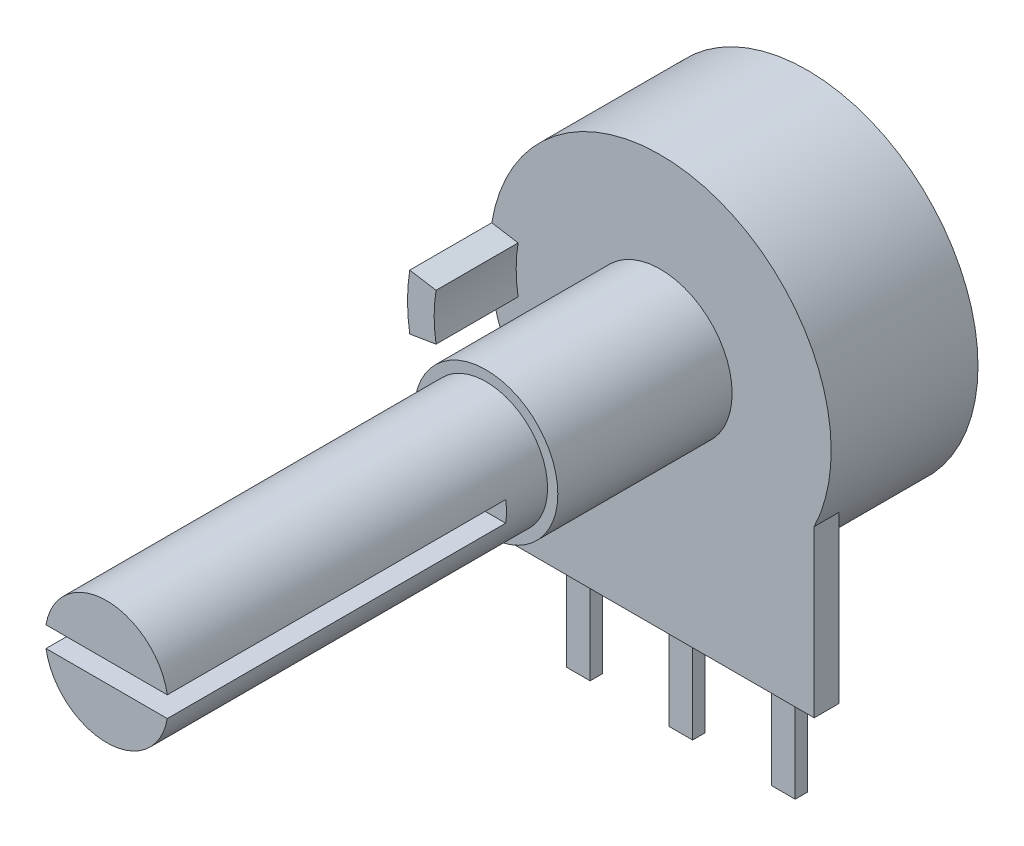
ISO-10303-21;
HEADER;
FILE_DESCRIPTION(('STEP AP214'),'2;1');
FILE_NAME('part.step','',(''),(''),'','','');
FILE_SCHEMA(('AUTOMOTIVE_DESIGN { 1 0 10303 214 1 1 1 1 }'));
ENDSEC;
DATA;
#1=APPLICATION_CONTEXT('core data for automotive mechanical design processes');
#2=APPLICATION_PROTOCOL_DEFINITION('international standard','automotive_design',2000,#1);
#3=PRODUCT_CONTEXT('',#1,'mechanical');
#4=PRODUCT('Part','Part','',(#3));
#5=PRODUCT_RELATED_PRODUCT_CATEGORY('part','',(#4));
#6=PRODUCT_DEFINITION_FORMATION('','',#4);
#7=PRODUCT_DEFINITION_CONTEXT('part definition',#1,'design');
#8=PRODUCT_DEFINITION('design','',#6,#7);
#9=PRODUCT_DEFINITION_SHAPE('','',#8);
#10=(LENGTH_UNIT() NAMED_UNIT(*) SI_UNIT(.MILLI.,.METRE.));
#11=(NAMED_UNIT(*) PLANE_ANGLE_UNIT() SI_UNIT($,.RADIAN.));
#12=(NAMED_UNIT(*) SI_UNIT($,.STERADIAN.) SOLID_ANGLE_UNIT());
#13=UNCERTAINTY_MEASURE_WITH_UNIT(LENGTH_MEASURE(1.E-05),#10,'distance_accuracy_value','');
#14=(GEOMETRIC_REPRESENTATION_CONTEXT(3) GLOBAL_UNCERTAINTY_ASSIGNED_CONTEXT((#13)) GLOBAL_UNIT_ASSIGNED_CONTEXT((#10,
#11,#12)) REPRESENTATION_CONTEXT('',''));
#15=CARTESIAN_POINT('',(0.,0.,0.));
#16=DIRECTION('',(0.,0.,1.));
#17=DIRECTION('',(1.,0.,0.));
#18=AXIS2_PLACEMENT_3D('',#15,#16,#17);
#19=CARTESIAN_POINT('',(0.,0.,7.16));
#20=DIRECTION('',(0.,0.,1.));
#21=DIRECTION('',(1.,0.,0.));
#22=AXIS2_PLACEMENT_3D('',#19,#20,#21);
#23=PLANE('',#22);
#24=CARTESIAN_POINT('',(0.,0.,7.16));
#25=DIRECTION('',(0.,0.,1.));
#26=DIRECTION('',(1.,0.,0.));
#27=AXIS2_PLACEMENT_3D('',#24,#25,#26);
#28=CIRCLE('',#27,3.5);
#29=CARTESIAN_POINT('',(3.5,0.,7.16));
#30=VERTEX_POINT('',#29);
#31=EDGE_CURVE('E400',#30,#30,#28,.T.);
#32=ORIENTED_EDGE('',*,*,#31,.F.);
#33=EDGE_LOOP('',(#32));
#34=FACE_BOUND('',#33,.T.);
#35=CARTESIAN_POINT('',(0.,0.,7.16));
#36=DIRECTION('',(0.,0.,1.));
#37=DIRECTION('',(1.,0.,0.));
#38=AXIS2_PLACEMENT_3D('',#35,#36,#37);
#39=CIRCLE('',#38,8.33);
#40=CARTESIAN_POINT('',(7.5,-3.62476206115657,7.16));
#41=VERTEX_POINT('',#40);
#42=CARTESIAN_POINT('',(-8.21987834459854,1.35,7.16));
#43=VERTEX_POINT('',#42);
#44=EDGE_CURVE('E404',#41,#43,#39,.T.);
#45=ORIENTED_EDGE('',*,*,#44,.T.);
#46=DIRECTION('',(-0.986780113397183,0.162064825930372,0.));
#47=VECTOR('',#46,1.);
#48=CARTESIAN_POINT('',(-8.21987834459854,1.35,7.16));
#49=LINE('',#48,#47);
#50=CARTESIAN_POINT('',(-6.9370641971822,1.13931572629052,7.16));
#51=VERTEX_POINT('',#50);
#52=EDGE_CURVE('E476',#51,#43,#49,.T.);
#53=ORIENTED_EDGE('',*,*,#52,.F.);
#54=CARTESIAN_POINT('',(0.,0.,7.16));
#55=DIRECTION('',(0.,0.,-1.));
#56=DIRECTION('',(-1.,0.,0.));
#57=AXIS2_PLACEMENT_3D('',#54,#55,#56);
#58=CIRCLE('',#57,7.03);
#59=CARTESIAN_POINT('',(-6.9370641971822,-1.13931572629052,7.16));
#60=VERTEX_POINT('',#59);
#61=EDGE_CURVE('E243',#60,#51,#58,.T.);
#62=ORIENTED_EDGE('',*,*,#61,.F.);
#63=DIRECTION('',(0.986780113397183,0.162064825930372,0.));
#64=VECTOR('',#63,1.);
#65=CARTESIAN_POINT('',(-8.21987834459854,-1.35,7.16));
#66=LINE('',#65,#64);
#67=CARTESIAN_POINT('',(-8.21987834459854,-1.35,7.16));
#68=VERTEX_POINT('',#67);
#69=EDGE_CURVE('E239',#68,#60,#66,.T.);
#70=ORIENTED_EDGE('',*,*,#69,.F.);
#71=CARTESIAN_POINT('',(-7.5,-3.62476206115657,7.16));
#72=VERTEX_POINT('',#71);
#73=EDGE_CURVE('E407',#68,#72,#39,.T.);
#74=ORIENTED_EDGE('',*,*,#73,.T.);
#75=DIRECTION('',(0.,-1.,0.));
#76=VECTOR('',#75,1.);
#77=CARTESIAN_POINT('',(-7.5,-11.7,7.16));
#78=LINE('',#77,#76);
#79=CARTESIAN_POINT('',(-7.5,-11.7,7.16));
#80=VERTEX_POINT('',#79);
#81=EDGE_CURVE('E359',#72,#80,#78,.T.);
#82=ORIENTED_EDGE('',*,*,#81,.T.);
#83=DIRECTION('',(1.,0.,0.));
#84=VECTOR('',#83,1.);
#85=CARTESIAN_POINT('',(-7.5,-11.7,7.16));
#86=LINE('',#85,#84);
#87=CARTESIAN_POINT('',(7.5,-11.7,7.16));
#88=VERTEX_POINT('',#87);
#89=EDGE_CURVE('E349',#80,#88,#86,.T.);
#90=ORIENTED_EDGE('',*,*,#89,.T.);
#91=DIRECTION('',(0.,1.,0.));
#92=VECTOR('',#91,1.);
#93=CARTESIAN_POINT('',(7.5,-11.7,7.16));
#94=LINE('',#93,#92);
#95=EDGE_CURVE('E344',#88,#41,#94,.T.);
#96=ORIENTED_EDGE('',*,*,#95,.T.);
#97=EDGE_LOOP('',(#45,#53,#62,#70,#74,#82,#90,#96));
#98=FACE_BOUND('',#97,.T.);
#99=ADVANCED_FACE('F38',(#34,#98),#23,.T.);
#100=CARTESIAN_POINT('',(0.,0.,34.16));
#101=DIRECTION('',(0.,0.,1.));
#102=DIRECTION('',(1.,0.,0.));
#103=AXIS2_PLACEMENT_3D('',#100,#101,#102);
#104=PLANE('',#103);
#105=DIRECTION('',(-1.,0.,0.));
#106=VECTOR('',#105,1.);
#107=CARTESIAN_POINT('',(0.,0.5,34.16));
#108=LINE('',#107,#106);
#109=CARTESIAN_POINT('',(2.95803989154981,0.5,34.16));
#110=VERTEX_POINT('',#109);
#111=CARTESIAN_POINT('',(-2.95803989154981,0.5,34.16));
#112=VERTEX_POINT('',#111);
#113=EDGE_CURVE('E413',#110,#112,#108,.T.);
#114=ORIENTED_EDGE('',*,*,#113,.F.);
#115=CARTESIAN_POINT('',(0.,0.,34.16));
#116=DIRECTION('',(0.,0.,1.));
#117=DIRECTION('',(1.,0.,0.));
#118=AXIS2_PLACEMENT_3D('',#115,#116,#117);
#119=CIRCLE('',#118,3.);
#120=EDGE_CURVE('E394',#110,#112,#119,.T.);
#121=ORIENTED_EDGE('',*,*,#120,.T.);
#122=EDGE_LOOP('',(#114,#121));
#123=FACE_BOUND('',#122,.T.);
#124=ADVANCED_FACE('F520',(#123),#104,.T.);
#125=CARTESIAN_POINT('',(0.,0.,7.16));
#126=DIRECTION('',(0.,0.,-1.));
#127=DIRECTION('',(-1.,0.,0.));
#128=AXIS2_PLACEMENT_3D('',#125,#126,#127);
#129=CYLINDRICAL_SURFACE('',#128,8.33);
#130=ORIENTED_EDGE('',*,*,#44,.F.);
#131=DIRECTION('',(0.,0.,-1.));
#132=VECTOR('',#131,1.);
#133=CARTESIAN_POINT('',(7.5,-3.62476206115657,7.16));
#134=LINE('',#133,#132);
#135=CARTESIAN_POINT('',(7.5,-3.62476206115657,5.96));
#136=VERTEX_POINT('',#135);
#137=EDGE_CURVE('E370',#41,#136,#134,.T.);
#138=ORIENTED_EDGE('',*,*,#137,.T.);
#139=CARTESIAN_POINT('',(0.,0.,5.96));
#140=DIRECTION('',(0.,0.,-1.));
#141=DIRECTION('',(-1.,0.,0.));
#142=AXIS2_PLACEMENT_3D('',#139,#140,#141);
#143=CIRCLE('',#142,8.33);
#144=CARTESIAN_POINT('',(-7.5,-3.62476206115657,5.96));
#145=VERTEX_POINT('',#144);
#146=EDGE_CURVE('E42',#136,#145,#143,.T.);
#147=ORIENTED_EDGE('',*,*,#146,.T.);
#148=DIRECTION('',(0.,0.,-1.));
#149=VECTOR('',#148,1.);
#150=CARTESIAN_POINT('',(-7.5,-3.62476206115657,7.16));
#151=LINE('',#150,#149);
#152=EDGE_CURVE('E365',#145,#72,#151,.F.);
#153=ORIENTED_EDGE('',*,*,#152,.T.);
#154=ORIENTED_EDGE('',*,*,#73,.F.);
#155=DIRECTION('',(0.,0.,-1.));
#156=VECTOR('',#155,1.);
#157=CARTESIAN_POINT('',(-8.21987834459854,-1.35,11.16));
#158=LINE('',#157,#156);
#159=CARTESIAN_POINT('',(-8.21987834459854,-1.35,11.16));
#160=VERTEX_POINT('',#159);
#161=EDGE_CURVE('E56',#160,#68,#158,.T.);
#162=ORIENTED_EDGE('',*,*,#161,.F.);
#163=CARTESIAN_POINT('',(0.,0.,11.16));
#164=DIRECTION('',(0.,0.,1.));
#165=DIRECTION('',(-1.,0.,0.));
#166=AXIS2_PLACEMENT_3D('',#163,#164,#165);
#167=CIRCLE('',#166,8.33);
#168=CARTESIAN_POINT('',(-8.21987834459854,1.35,11.16));
#169=VERTEX_POINT('',#168);
#170=EDGE_CURVE('E230',#169,#160,#167,.T.);
#171=ORIENTED_EDGE('',*,*,#170,.F.);
#172=DIRECTION('',(0.,0.,-1.));
#173=VECTOR('',#172,1.);
#174=CARTESIAN_POINT('',(-8.21987834459854,1.35,11.16));
#175=LINE('',#174,#173);
#176=EDGE_CURVE('E227',#169,#43,#175,.T.);
#177=ORIENTED_EDGE('',*,*,#176,.T.);
#178=EDGE_LOOP('',(#130,#138,#147,#153,#154,#162,#171,#177));
#179=FACE_BOUND('',#178,.T.);
#180=CARTESIAN_POINT('',(0.,0.,0.));
#181=DIRECTION('',(0.,0.,1.));
#182=DIRECTION('',(1.,0.,0.));
#183=AXIS2_PLACEMENT_3D('',#180,#181,#182);
#184=CIRCLE('',#183,8.33);
#185=CARTESIAN_POINT('',(8.33,0.,0.));
#186=VERTEX_POINT('',#185);
#187=EDGE_CURVE('E398',#186,#186,#184,.T.);
#188=ORIENTED_EDGE('',*,*,#187,.T.);
#189=EDGE_LOOP('',(#188));
#190=FACE_BOUND('',#189,.T.);
#191=ADVANCED_FACE('F40',(#179,#190),#129,.T.);
#192=CARTESIAN_POINT('',(0.,0.,0.));
#193=DIRECTION('',(0.,0.,1.));
#194=DIRECTION('',(1.,0.,0.));
#195=AXIS2_PLACEMENT_3D('',#192,#193,#194);
#196=PLANE('',#195);
#197=ORIENTED_EDGE('',*,*,#187,.F.);
#198=EDGE_LOOP('',(#197));
#199=FACE_BOUND('',#198,.T.);
#200=ADVANCED_FACE('F533',(#199),#196,.F.);
#201=CARTESIAN_POINT('',(0.,0.,15.66));
#202=DIRECTION('',(0.,0.,-1.));
#203=DIRECTION('',(-1.,0.,0.));
#204=AXIS2_PLACEMENT_3D('',#201,#202,#203);
#205=CYLINDRICAL_SURFACE('',#204,3.5);
#206=CARTESIAN_POINT('',(0.,0.,15.66));
#207=DIRECTION('',(0.,0.,1.));
#208=DIRECTION('',(1.,0.,0.));
#209=AXIS2_PLACEMENT_3D('',#206,#207,#208);
#210=CIRCLE('',#209,3.5);
#211=CARTESIAN_POINT('',(3.5,0.,15.66));
#212=VERTEX_POINT('',#211);
#213=EDGE_CURVE('E395',#212,#212,#210,.T.);
#214=ORIENTED_EDGE('',*,*,#213,.F.);
#215=EDGE_LOOP('',(#214));
#216=FACE_BOUND('',#215,.T.);
#217=ORIENTED_EDGE('',*,*,#31,.T.);
#218=EDGE_LOOP('',(#217));
#219=FACE_BOUND('',#218,.T.);
#220=ADVANCED_FACE('F531',(#216,#219),#205,.T.);
#221=CARTESIAN_POINT('',(0.,0.,15.66));
#222=DIRECTION('',(0.,0.,1.));
#223=DIRECTION('',(1.,0.,0.));
#224=AXIS2_PLACEMENT_3D('',#221,#222,#223);
#225=PLANE('',#224);
#226=CARTESIAN_POINT('',(0.,0.,15.66));
#227=DIRECTION('',(0.,0.,1.));
#228=DIRECTION('',(1.,0.,0.));
#229=AXIS2_PLACEMENT_3D('',#226,#227,#228);
#230=CIRCLE('',#229,3.);
#231=CARTESIAN_POINT('',(3.,0.,15.66));
#232=VERTEX_POINT('',#231);
#233=EDGE_CURVE('E399',#232,#232,#230,.F.);
#234=ORIENTED_EDGE('',*,*,#233,.T.);
#235=EDGE_LOOP('',(#234));
#236=FACE_BOUND('',#235,.T.);
#237=ORIENTED_EDGE('',*,*,#213,.T.);
#238=EDGE_LOOP('',(#237));
#239=FACE_BOUND('',#238,.T.);
#240=ADVANCED_FACE('F540',(#236,#239),#225,.T.);
#241=CARTESIAN_POINT('',(0.,0.,34.16));
#242=DIRECTION('',(0.,0.,-1.));
#243=DIRECTION('',(-1.,0.,0.));
#244=AXIS2_PLACEMENT_3D('',#241,#242,#243);
#245=CYLINDRICAL_SURFACE('',#244,3.);
#246=CARTESIAN_POINT('',(0.,0.,17.66));
#247=DIRECTION('',(0.,0.,1.));
#248=DIRECTION('',(1.,0.,0.));
#249=AXIS2_PLACEMENT_3D('',#246,#247,#248);
#250=CIRCLE('',#249,3.);
#251=CARTESIAN_POINT('',(-2.95803989154981,0.5,17.66));
#252=VERTEX_POINT('',#251);
#253=CARTESIAN_POINT('',(-2.95803989154981,-0.5,17.66));
#254=VERTEX_POINT('',#253);
#255=EDGE_CURVE('E415',#252,#254,#250,.T.);
#256=ORIENTED_EDGE('',*,*,#255,.F.);
#257=DIRECTION('',(0.,0.,-1.));
#258=VECTOR('',#257,1.);
#259=CARTESIAN_POINT('',(-2.95803989154981,0.5,34.16));
#260=LINE('',#259,#258);
#261=EDGE_CURVE('E385',#252,#112,#260,.F.);
#262=ORIENTED_EDGE('',*,*,#261,.T.);
#263=ORIENTED_EDGE('',*,*,#120,.F.);
#264=DIRECTION('',(0.,0.,-1.));
#265=VECTOR('',#264,1.);
#266=CARTESIAN_POINT('',(2.95803989154981,0.5,34.16));
#267=LINE('',#266,#265);
#268=CARTESIAN_POINT('',(2.95803989154981,0.5,17.66));
#269=VERTEX_POINT('',#268);
#270=EDGE_CURVE('E388',#110,#269,#267,.T.);
#271=ORIENTED_EDGE('',*,*,#270,.T.);
#272=CARTESIAN_POINT('',(2.95803989154981,-0.5,17.66));
#273=VERTEX_POINT('',#272);
#274=EDGE_CURVE('E414',#273,#269,#250,.T.);
#275=ORIENTED_EDGE('',*,*,#274,.F.);
#276=DIRECTION('',(0.,0.,-1.));
#277=VECTOR('',#276,1.);
#278=CARTESIAN_POINT('',(2.95803989154981,-0.5,34.16));
#279=LINE('',#278,#277);
#280=CARTESIAN_POINT('',(2.95803989154981,-0.5,34.16));
#281=VERTEX_POINT('',#280);
#282=EDGE_CURVE('E379',#273,#281,#279,.F.);
#283=ORIENTED_EDGE('',*,*,#282,.T.);
#284=CARTESIAN_POINT('',(-2.95803989154981,-0.5,34.16));
#285=VERTEX_POINT('',#284);
#286=EDGE_CURVE('E391',#285,#281,#119,.T.);
#287=ORIENTED_EDGE('',*,*,#286,.F.);
#288=DIRECTION('',(0.,0.,-1.));
#289=VECTOR('',#288,1.);
#290=CARTESIAN_POINT('',(-2.95803989154981,-0.5,34.16));
#291=LINE('',#290,#289);
#292=EDGE_CURVE('E382',#285,#254,#291,.T.);
#293=ORIENTED_EDGE('',*,*,#292,.T.);
#294=EDGE_LOOP('',(#256,#262,#263,#271,#275,#283,#287,#293));
#295=FACE_BOUND('',#294,.T.);
#296=ORIENTED_EDGE('',*,*,#233,.F.);
#297=EDGE_LOOP('',(#296));
#298=FACE_BOUND('',#297,.T.);
#299=ADVANCED_FACE('F561',(#295,#298),#245,.T.);
#300=DIRECTION('',(1.,0.,0.));
#301=VECTOR('',#300,1.);
#302=CARTESIAN_POINT('',(0.,-0.5,34.16));
#303=LINE('',#302,#301);
#304=EDGE_CURVE('E403',#285,#281,#303,.T.);
#305=ORIENTED_EDGE('',*,*,#304,.F.);
#306=ORIENTED_EDGE('',*,*,#286,.T.);
#307=EDGE_LOOP('',(#305,#306));
#308=FACE_BOUND('',#307,.T.);
#309=ADVANCED_FACE('F528',(#308),#104,.T.);
#310=CARTESIAN_POINT('',(0.,0.,17.66));
#311=DIRECTION('',(0.,0.,1.));
#312=DIRECTION('',(1.,0.,0.));
#313=AXIS2_PLACEMENT_3D('',#310,#311,#312);
#314=PLANE('',#313);
#315=DIRECTION('',(1.,0.,0.));
#316=VECTOR('',#315,1.);
#317=CARTESIAN_POINT('',(-3.,0.5,17.66));
#318=LINE('',#317,#316);
#319=EDGE_CURVE('E373',#252,#269,#318,.T.);
#320=ORIENTED_EDGE('',*,*,#319,.F.);
#321=ORIENTED_EDGE('',*,*,#255,.T.);
#322=DIRECTION('',(-1.,0.,0.));
#323=VECTOR('',#322,1.);
#324=CARTESIAN_POINT('',(-3.,-0.5,17.66));
#325=LINE('',#324,#323);
#326=EDGE_CURVE('E376',#273,#254,#325,.T.);
#327=ORIENTED_EDGE('',*,*,#326,.F.);
#328=ORIENTED_EDGE('',*,*,#274,.T.);
#329=EDGE_LOOP('',(#320,#321,#327,#328));
#330=FACE_BOUND('',#329,.T.);
#331=ADVANCED_FACE('F574',(#330),#314,.T.);
#332=CARTESIAN_POINT('',(-3.,0.5,9.57723746970178));
#333=DIRECTION('',(0.,1.,0.));
#334=DIRECTION('',(0.,0.,1.));
#335=AXIS2_PLACEMENT_3D('',#332,#333,#334);
#336=PLANE('',#335);
#337=ORIENTED_EDGE('',*,*,#113,.T.);
#338=ORIENTED_EDGE('',*,*,#261,.F.);
#339=ORIENTED_EDGE('',*,*,#319,.T.);
#340=ORIENTED_EDGE('',*,*,#270,.F.);
#341=EDGE_LOOP('',(#337,#338,#339,#340));
#342=FACE_BOUND('',#341,.T.);
#343=ADVANCED_FACE('F582',(#342),#336,.F.);
#344=CARTESIAN_POINT('',(-3.,-0.5,9.57723746970178));
#345=DIRECTION('',(0.,-1.,0.));
#346=DIRECTION('',(0.,0.,-1.));
#347=AXIS2_PLACEMENT_3D('',#344,#345,#346);
#348=PLANE('',#347);
#349=ORIENTED_EDGE('',*,*,#304,.T.);
#350=ORIENTED_EDGE('',*,*,#282,.F.);
#351=ORIENTED_EDGE('',*,*,#326,.T.);
#352=ORIENTED_EDGE('',*,*,#292,.F.);
#353=EDGE_LOOP('',(#349,#350,#351,#352));
#354=FACE_BOUND('',#353,.T.);
#355=ADVANCED_FACE('F591',(#354),#348,.F.);
#356=CARTESIAN_POINT('',(7.5,-11.7,5.96));
#357=DIRECTION('',(1.,0.,0.));
#358=DIRECTION('',(0.,0.,-1.));
#359=AXIS2_PLACEMENT_3D('',#356,#357,#358);
#360=PLANE('',#359);
#361=ORIENTED_EDGE('',*,*,#137,.F.);
#362=ORIENTED_EDGE('',*,*,#95,.F.);
#363=DIRECTION('',(0.,0.,1.));
#364=VECTOR('',#363,1.);
#365=CARTESIAN_POINT('',(7.5,-11.7,5.96));
#366=LINE('',#365,#364);
#367=CARTESIAN_POINT('',(7.5,-11.7,5.96));
#368=VERTEX_POINT('',#367);
#369=EDGE_CURVE('E363',#368,#88,#366,.T.);
#370=ORIENTED_EDGE('',*,*,#369,.F.);
#371=DIRECTION('',(0.,1.,0.));
#372=VECTOR('',#371,1.);
#373=CARTESIAN_POINT('',(7.5,-11.7,5.96));
#374=LINE('',#373,#372);
#375=EDGE_CURVE('E345',#368,#136,#374,.T.);
#376=ORIENTED_EDGE('',*,*,#375,.T.);
#377=EDGE_LOOP('',(#361,#362,#370,#376));
#378=FACE_BOUND('',#377,.T.);
#379=ADVANCED_FACE('F488',(#378),#360,.T.);
#380=CARTESIAN_POINT('',(-7.5,-11.7,5.96));
#381=DIRECTION('',(-1.,0.,0.));
#382=DIRECTION('',(0.,0.,1.));
#383=AXIS2_PLACEMENT_3D('',#380,#381,#382);
#384=PLANE('',#383);
#385=ORIENTED_EDGE('',*,*,#152,.F.);
#386=DIRECTION('',(0.,-1.,0.));
#387=VECTOR('',#386,1.);
#388=CARTESIAN_POINT('',(-7.5,-11.7,5.96));
#389=LINE('',#388,#387);
#390=CARTESIAN_POINT('',(-7.5,-11.7,5.96));
#391=VERTEX_POINT('',#390);
#392=EDGE_CURVE('E348',#145,#391,#389,.T.);
#393=ORIENTED_EDGE('',*,*,#392,.T.);
#394=DIRECTION('',(0.,0.,1.));
#395=VECTOR('',#394,1.);
#396=CARTESIAN_POINT('',(-7.5,-11.7,5.96));
#397=LINE('',#396,#395);
#398=EDGE_CURVE('E355',#391,#80,#397,.T.);
#399=ORIENTED_EDGE('',*,*,#398,.T.);
#400=ORIENTED_EDGE('',*,*,#81,.F.);
#401=EDGE_LOOP('',(#385,#393,#399,#400));
#402=FACE_BOUND('',#401,.T.);
#403=ADVANCED_FACE('F470',(#402),#384,.T.);
#404=CARTESIAN_POINT('',(-7.5,-11.7,5.96));
#405=DIRECTION('',(0.,-1.,0.));
#406=DIRECTION('',(1.,0.,0.));
#407=AXIS2_PLACEMENT_3D('',#404,#405,#406);
#408=PLANE('',#407);
#409=DIRECTION('',(0.,0.,1.));
#410=VECTOR('',#409,1.);
#411=CARTESIAN_POINT('',(4.425,-11.7,5.56));
#412=LINE('',#411,#410);
#413=CARTESIAN_POINT('',(4.425,-11.7,5.96));
#414=VERTEX_POINT('',#413);
#415=CARTESIAN_POINT('',(4.425,-11.7,6.16));
#416=VERTEX_POINT('',#415);
#417=EDGE_CURVE('E277',#414,#416,#412,.T.);
#418=ORIENTED_EDGE('',*,*,#417,.T.);
#419=DIRECTION('',(-1.,0.,0.));
#420=VECTOR('',#419,1.);
#421=CARTESIAN_POINT('',(5.,-11.7,6.16));
#422=LINE('',#421,#420);
#423=CARTESIAN_POINT('',(5.575,-11.7,6.16));
#424=VERTEX_POINT('',#423);
#425=EDGE_CURVE('E64',#424,#416,#422,.T.);
#426=ORIENTED_EDGE('',*,*,#425,.F.);
#427=DIRECTION('',(0.,0.,1.));
#428=VECTOR('',#427,1.);
#429=CARTESIAN_POINT('',(5.575,-11.7,5.56));
#430=LINE('',#429,#428);
#431=CARTESIAN_POINT('',(5.575,-11.7,5.96));
#432=VERTEX_POINT('',#431);
#433=EDGE_CURVE('E273',#432,#424,#430,.T.);
#434=ORIENTED_EDGE('',*,*,#433,.F.);
#435=DIRECTION('',(1.,0.,0.));
#436=VECTOR('',#435,1.);
#437=CARTESIAN_POINT('',(-7.5,-11.7,5.96));
#438=LINE('',#437,#436);
#439=EDGE_CURVE('E351',#432,#368,#438,.T.);
#440=ORIENTED_EDGE('',*,*,#439,.T.);
#441=ORIENTED_EDGE('',*,*,#369,.T.);
#442=ORIENTED_EDGE('',*,*,#89,.F.);
#443=ORIENTED_EDGE('',*,*,#398,.F.);
#444=CARTESIAN_POINT('',(-5.575,-11.7,5.96));
#445=VERTEX_POINT('',#444);
#446=EDGE_CURVE('E352',#391,#445,#438,.T.);
#447=ORIENTED_EDGE('',*,*,#446,.T.);
#448=DIRECTION('',(0.,0.,1.));
#449=VECTOR('',#448,1.);
#450=CARTESIAN_POINT('',(-5.575,-11.7,5.56));
#451=LINE('',#450,#449);
#452=CARTESIAN_POINT('',(-5.575,-11.7,6.16));
#453=VERTEX_POINT('',#452);
#454=EDGE_CURVE('E311',#445,#453,#451,.T.);
#455=ORIENTED_EDGE('',*,*,#454,.T.);
#456=DIRECTION('',(-1.,0.,0.));
#457=VECTOR('',#456,1.);
#458=CARTESIAN_POINT('',(-5.,-11.7,6.16));
#459=LINE('',#458,#457);
#460=CARTESIAN_POINT('',(-4.425,-11.7,6.16));
#461=VERTEX_POINT('',#460);
#462=EDGE_CURVE('E296',#461,#453,#459,.T.);
#463=ORIENTED_EDGE('',*,*,#462,.F.);
#464=DIRECTION('',(0.,0.,1.));
#465=VECTOR('',#464,1.);
#466=CARTESIAN_POINT('',(-4.425,-11.7,5.56));
#467=LINE('',#466,#465);
#468=CARTESIAN_POINT('',(-4.425,-11.7,5.96));
#469=VERTEX_POINT('',#468);
#470=EDGE_CURVE('E307',#469,#461,#467,.T.);
#471=ORIENTED_EDGE('',*,*,#470,.F.);
#472=CARTESIAN_POINT('',(-0.575,-11.7,5.96));
#473=VERTEX_POINT('',#472);
#474=EDGE_CURVE('E428',#469,#473,#438,.T.);
#475=ORIENTED_EDGE('',*,*,#474,.T.);
#476=DIRECTION('',(0.,0.,1.));
#477=VECTOR('',#476,1.);
#478=CARTESIAN_POINT('',(-0.575,-11.7,5.56));
#479=LINE('',#478,#477);
#480=CARTESIAN_POINT('',(-0.575,-11.7,6.16));
#481=VERTEX_POINT('',#480);
#482=EDGE_CURVE('E47',#473,#481,#479,.T.);
#483=ORIENTED_EDGE('',*,*,#482,.T.);
#484=DIRECTION('',(-1.,0.,0.));
#485=VECTOR('',#484,1.);
#486=CARTESIAN_POINT('',(0.,-11.7,6.16));
#487=LINE('',#486,#485);
#488=CARTESIAN_POINT('',(0.575,-11.7,6.16));
#489=VERTEX_POINT('',#488);
#490=EDGE_CURVE('E330',#489,#481,#487,.T.);
#491=ORIENTED_EDGE('',*,*,#490,.F.);
#492=DIRECTION('',(0.,0.,1.));
#493=VECTOR('',#492,1.);
#494=CARTESIAN_POINT('',(0.575,-11.7,5.56));
#495=LINE('',#494,#493);
#496=CARTESIAN_POINT('',(0.575,-11.7,5.96));
#497=VERTEX_POINT('',#496);
#498=EDGE_CURVE('E13',#497,#489,#495,.T.);
#499=ORIENTED_EDGE('',*,*,#498,.F.);
#500=EDGE_CURVE('E441',#497,#414,#438,.T.);
#501=ORIENTED_EDGE('',*,*,#500,.T.);
#502=EDGE_LOOP('',(#418,#426,#434,#440,#441,#442,#443,#447,#455,#463,#471,#475,#483,#491,#499,#501));
#503=FACE_BOUND('',#502,.T.);
#504=ADVANCED_FACE('F425',(#503),#408,.T.);
#505=CARTESIAN_POINT('',(0.,0.,5.96));
#506=DIRECTION('',(0.,0.,-1.));
#507=DIRECTION('',(-1.,0.,0.));
#508=AXIS2_PLACEMENT_3D('',#505,#506,#507);
#509=PLANE('',#508);
#510=ORIENTED_EDGE('',*,*,#146,.F.);
#511=ORIENTED_EDGE('',*,*,#375,.F.);
#512=ORIENTED_EDGE('',*,*,#439,.F.);
#513=EDGE_CURVE('E442',#414,#432,#438,.T.);
#514=ORIENTED_EDGE('',*,*,#513,.F.);
#515=ORIENTED_EDGE('',*,*,#500,.F.);
#516=EDGE_CURVE('E357',#473,#497,#438,.T.);
#517=ORIENTED_EDGE('',*,*,#516,.F.);
#518=ORIENTED_EDGE('',*,*,#474,.F.);
#519=EDGE_CURVE('E356',#445,#469,#438,.T.);
#520=ORIENTED_EDGE('',*,*,#519,.F.);
#521=ORIENTED_EDGE('',*,*,#446,.F.);
#522=ORIENTED_EDGE('',*,*,#392,.F.);
#523=EDGE_LOOP('',(#510,#511,#512,#514,#515,#517,#518,#520,#521,#522));
#524=FACE_BOUND('',#523,.T.);
#525=ADVANCED_FACE('F439',(#524),#509,.T.);
#526=CARTESIAN_POINT('',(-0.575,0.,5.56));
#527=DIRECTION('',(-1.,0.,0.));
#528=DIRECTION('',(0.,0.,1.));
#529=AXIS2_PLACEMENT_3D('',#526,#527,#528);
#530=PLANE('',#529);
#531=DIRECTION('',(0.,-1.,0.));
#532=VECTOR('',#531,1.);
#533=CARTESIAN_POINT('',(-0.575,0.,6.16));
#534=LINE('',#533,#532);
#535=CARTESIAN_POINT('',(-0.575,-16.6,6.16));
#536=VERTEX_POINT('',#535);
#537=EDGE_CURVE('E315',#481,#536,#534,.T.);
#538=ORIENTED_EDGE('',*,*,#537,.F.);
#539=ORIENTED_EDGE('',*,*,#482,.F.);
#540=CARTESIAN_POINT('',(-0.575,-11.7,5.56));
#541=VERTEX_POINT('',#540);
#542=EDGE_CURVE('E341',#541,#473,#479,.T.);
#543=ORIENTED_EDGE('',*,*,#542,.F.);
#544=DIRECTION('',(0.,-1.,0.));
#545=VECTOR('',#544,1.);
#546=CARTESIAN_POINT('',(-0.575,0.,5.56));
#547=LINE('',#546,#545);
#548=CARTESIAN_POINT('',(-0.575,-16.6,5.56));
#549=VERTEX_POINT('',#548);
#550=EDGE_CURVE('E316',#541,#549,#547,.T.);
#551=ORIENTED_EDGE('',*,*,#550,.T.);
#552=DIRECTION('',(0.,0.,1.));
#553=VECTOR('',#552,1.);
#554=CARTESIAN_POINT('',(-0.575,-16.6,5.56));
#555=LINE('',#554,#553);
#556=EDGE_CURVE('E327',#549,#536,#555,.T.);
#557=ORIENTED_EDGE('',*,*,#556,.T.);
#558=EDGE_LOOP('',(#538,#539,#543,#551,#557));
#559=FACE_BOUND('',#558,.T.);
#560=ADVANCED_FACE('F431',(#559),#530,.T.);
#561=CARTESIAN_POINT('',(0.,-11.7,5.56));
#562=DIRECTION('',(0.,1.,0.));
#563=DIRECTION('',(-1.,0.,0.));
#564=AXIS2_PLACEMENT_3D('',#561,#562,#563);
#565=PLANE('',#564);
#566=ORIENTED_EDGE('',*,*,#542,.T.);
#567=ORIENTED_EDGE('',*,*,#516,.T.);
#568=CARTESIAN_POINT('',(0.575,-11.7,5.56));
#569=VERTEX_POINT('',#568);
#570=EDGE_CURVE('E49',#569,#497,#495,.T.);
#571=ORIENTED_EDGE('',*,*,#570,.F.);
#572=DIRECTION('',(-1.,0.,0.));
#573=VECTOR('',#572,1.);
#574=CARTESIAN_POINT('',(0.,-11.7,5.56));
#575=LINE('',#574,#573);
#576=EDGE_CURVE('E319',#569,#541,#575,.T.);
#577=ORIENTED_EDGE('',*,*,#576,.T.);
#578=EDGE_LOOP('',(#566,#567,#571,#577));
#579=FACE_BOUND('',#578,.T.);
#580=ADVANCED_FACE('F435',(#579),#565,.T.);
#581=CARTESIAN_POINT('',(0.575,0.,5.56));
#582=DIRECTION('',(-1.,0.,0.));
#583=DIRECTION('',(0.,0.,1.));
#584=AXIS2_PLACEMENT_3D('',#581,#582,#583);
#585=PLANE('',#584);
#586=DIRECTION('',(0.,-1.,0.));
#587=VECTOR('',#586,1.);
#588=CARTESIAN_POINT('',(0.575,0.,6.16));
#589=LINE('',#588,#587);
#590=CARTESIAN_POINT('',(0.575,-16.6,6.16));
#591=VERTEX_POINT('',#590);
#592=EDGE_CURVE('E332',#489,#591,#589,.T.);
#593=ORIENTED_EDGE('',*,*,#592,.T.);
#594=DIRECTION('',(0.,0.,1.));
#595=VECTOR('',#594,1.);
#596=CARTESIAN_POINT('',(0.575,-16.6,5.56));
#597=LINE('',#596,#595);
#598=CARTESIAN_POINT('',(0.575,-16.6,5.56));
#599=VERTEX_POINT('',#598);
#600=EDGE_CURVE('E337',#599,#591,#597,.T.);
#601=ORIENTED_EDGE('',*,*,#600,.F.);
#602=DIRECTION('',(0.,-1.,0.));
#603=VECTOR('',#602,1.);
#604=CARTESIAN_POINT('',(0.575,0.,5.56));
#605=LINE('',#604,#603);
#606=EDGE_CURVE('E323',#569,#599,#605,.T.);
#607=ORIENTED_EDGE('',*,*,#606,.F.);
#608=ORIENTED_EDGE('',*,*,#570,.T.);
#609=ORIENTED_EDGE('',*,*,#498,.T.);
#610=EDGE_LOOP('',(#593,#601,#607,#608,#609));
#611=FACE_BOUND('',#610,.T.);
#612=ADVANCED_FACE('F646',(#611),#585,.F.);
#613=CARTESIAN_POINT('',(0.,-16.6,5.56));
#614=DIRECTION('',(0.,1.,0.));
#615=DIRECTION('',(0.,0.,1.));
#616=AXIS2_PLACEMENT_3D('',#613,#614,#615);
#617=PLANE('',#616);
#618=DIRECTION('',(-1.,0.,0.));
#619=VECTOR('',#618,1.);
#620=CARTESIAN_POINT('',(0.,-16.6,6.16));
#621=LINE('',#620,#619);
#622=EDGE_CURVE('E320',#591,#536,#621,.T.);
#623=ORIENTED_EDGE('',*,*,#622,.T.);
#624=ORIENTED_EDGE('',*,*,#556,.F.);
#625=DIRECTION('',(-1.,0.,0.));
#626=VECTOR('',#625,1.);
#627=CARTESIAN_POINT('',(0.,-16.6,5.56));
#628=LINE('',#627,#626);
#629=EDGE_CURVE('E325',#599,#549,#628,.T.);
#630=ORIENTED_EDGE('',*,*,#629,.F.);
#631=ORIENTED_EDGE('',*,*,#600,.T.);
#632=EDGE_LOOP('',(#623,#624,#630,#631));
#633=FACE_BOUND('',#632,.T.);
#634=ADVANCED_FACE('F655',(#633),#617,.F.);
#635=CARTESIAN_POINT('',(0.,0.,5.56));
#636=DIRECTION('',(0.,0.,-1.));
#637=DIRECTION('',(-1.,0.,0.));
#638=AXIS2_PLACEMENT_3D('',#635,#636,#637);
#639=PLANE('',#638);
#640=ORIENTED_EDGE('',*,*,#550,.F.);
#641=ORIENTED_EDGE('',*,*,#576,.F.);
#642=ORIENTED_EDGE('',*,*,#606,.T.);
#643=ORIENTED_EDGE('',*,*,#629,.T.);
#644=EDGE_LOOP('',(#640,#641,#642,#643));
#645=FACE_BOUND('',#644,.T.);
#646=ADVANCED_FACE('F665',(#645),#639,.T.);
#647=CARTESIAN_POINT('',(0.,0.,6.16));
#648=DIRECTION('',(0.,0.,-1.));
#649=DIRECTION('',(-1.,0.,0.));
#650=AXIS2_PLACEMENT_3D('',#647,#648,#649);
#651=PLANE('',#650);
#652=ORIENTED_EDGE('',*,*,#537,.T.);
#653=ORIENTED_EDGE('',*,*,#622,.F.);
#654=ORIENTED_EDGE('',*,*,#592,.F.);
#655=ORIENTED_EDGE('',*,*,#490,.T.);
#656=EDGE_LOOP('',(#652,#653,#654,#655));
#657=FACE_BOUND('',#656,.T.);
#658=ADVANCED_FACE('F675',(#657),#651,.F.);
#659=CARTESIAN_POINT('',(-5.575,0.,5.56));
#660=DIRECTION('',(-1.,0.,0.));
#661=DIRECTION('',(0.,0.,1.));
#662=AXIS2_PLACEMENT_3D('',#659,#660,#661);
#663=PLANE('',#662);
#664=DIRECTION('',(0.,-1.,0.));
#665=VECTOR('',#664,1.);
#666=CARTESIAN_POINT('',(-5.575,0.,6.16));
#667=LINE('',#666,#665);
#668=CARTESIAN_POINT('',(-5.575,-16.6,6.16));
#669=VERTEX_POINT('',#668);
#670=EDGE_CURVE('E281',#453,#669,#667,.T.);
#671=ORIENTED_EDGE('',*,*,#670,.F.);
#672=ORIENTED_EDGE('',*,*,#454,.F.);
#673=CARTESIAN_POINT('',(-5.575,-11.7,5.56));
#674=VERTEX_POINT('',#673);
#675=EDGE_CURVE('E312',#674,#445,#451,.T.);
#676=ORIENTED_EDGE('',*,*,#675,.F.);
#677=DIRECTION('',(0.,-1.,0.));
#678=VECTOR('',#677,1.);
#679=CARTESIAN_POINT('',(-5.575,0.,5.56));
#680=LINE('',#679,#678);
#681=CARTESIAN_POINT('',(-5.575,-16.6,5.56));
#682=VERTEX_POINT('',#681);
#683=EDGE_CURVE('E282',#674,#682,#680,.T.);
#684=ORIENTED_EDGE('',*,*,#683,.T.);
#685=DIRECTION('',(0.,0.,1.));
#686=VECTOR('',#685,1.);
#687=CARTESIAN_POINT('',(-5.575,-16.6,5.56));
#688=LINE('',#687,#686);
#689=EDGE_CURVE('E293',#682,#669,#688,.T.);
#690=ORIENTED_EDGE('',*,*,#689,.T.);
#691=EDGE_LOOP('',(#671,#672,#676,#684,#690));
#692=FACE_BOUND('',#691,.T.);
#693=ADVANCED_FACE('F463',(#692),#663,.T.);
#694=CARTESIAN_POINT('',(-5.,-11.7,5.56));
#695=DIRECTION('',(0.,1.,0.));
#696=DIRECTION('',(-1.,0.,0.));
#697=AXIS2_PLACEMENT_3D('',#694,#695,#696);
#698=PLANE('',#697);
#699=ORIENTED_EDGE('',*,*,#675,.T.);
#700=ORIENTED_EDGE('',*,*,#519,.T.);
#701=CARTESIAN_POINT('',(-4.425,-11.7,5.56));
#702=VERTEX_POINT('',#701);
#703=EDGE_CURVE('E308',#702,#469,#467,.T.);
#704=ORIENTED_EDGE('',*,*,#703,.F.);
#705=DIRECTION('',(-1.,0.,0.));
#706=VECTOR('',#705,1.);
#707=CARTESIAN_POINT('',(-5.,-11.7,5.56));
#708=LINE('',#707,#706);
#709=EDGE_CURVE('E285',#702,#674,#708,.T.);
#710=ORIENTED_EDGE('',*,*,#709,.T.);
#711=EDGE_LOOP('',(#699,#700,#704,#710));
#712=FACE_BOUND('',#711,.T.);
#713=ADVANCED_FACE('F447',(#712),#698,.T.);
#714=CARTESIAN_POINT('',(-4.425,0.,5.56));
#715=DIRECTION('',(-1.,0.,0.));
#716=DIRECTION('',(0.,0.,1.));
#717=AXIS2_PLACEMENT_3D('',#714,#715,#716);
#718=PLANE('',#717);
#719=DIRECTION('',(0.,-1.,0.));
#720=VECTOR('',#719,1.);
#721=CARTESIAN_POINT('',(-4.425,0.,6.16));
#722=LINE('',#721,#720);
#723=CARTESIAN_POINT('',(-4.425,-16.6,6.16));
#724=VERTEX_POINT('',#723);
#725=EDGE_CURVE('E299',#461,#724,#722,.T.);
#726=ORIENTED_EDGE('',*,*,#725,.T.);
#727=DIRECTION('',(0.,0.,1.));
#728=VECTOR('',#727,1.);
#729=CARTESIAN_POINT('',(-4.425,-16.6,5.56));
#730=LINE('',#729,#728);
#731=CARTESIAN_POINT('',(-4.425,-16.6,5.56));
#732=VERTEX_POINT('',#731);
#733=EDGE_CURVE('E304',#732,#724,#730,.T.);
#734=ORIENTED_EDGE('',*,*,#733,.F.);
#735=DIRECTION('',(0.,-1.,0.));
#736=VECTOR('',#735,1.);
#737=CARTESIAN_POINT('',(-4.425,0.,5.56));
#738=LINE('',#737,#736);
#739=EDGE_CURVE('E289',#702,#732,#738,.T.);
#740=ORIENTED_EDGE('',*,*,#739,.F.);
#741=ORIENTED_EDGE('',*,*,#703,.T.);
#742=ORIENTED_EDGE('',*,*,#470,.T.);
#743=EDGE_LOOP('',(#726,#734,#740,#741,#742));
#744=FACE_BOUND('',#743,.T.);
#745=ADVANCED_FACE('F452',(#744),#718,.F.);
#746=CARTESIAN_POINT('',(-5.,-16.6,5.56));
#747=DIRECTION('',(0.,1.,0.));
#748=DIRECTION('',(0.,0.,1.));
#749=AXIS2_PLACEMENT_3D('',#746,#747,#748);
#750=PLANE('',#749);
#751=DIRECTION('',(-1.,0.,0.));
#752=VECTOR('',#751,1.);
#753=CARTESIAN_POINT('',(-5.,-16.6,6.16));
#754=LINE('',#753,#752);
#755=EDGE_CURVE('E286',#724,#669,#754,.T.);
#756=ORIENTED_EDGE('',*,*,#755,.T.);
#757=ORIENTED_EDGE('',*,*,#689,.F.);
#758=DIRECTION('',(-1.,0.,0.));
#759=VECTOR('',#758,1.);
#760=CARTESIAN_POINT('',(-5.,-16.6,5.56));
#761=LINE('',#760,#759);
#762=EDGE_CURVE('E291',#732,#682,#761,.T.);
#763=ORIENTED_EDGE('',*,*,#762,.F.);
#764=ORIENTED_EDGE('',*,*,#733,.T.);
#765=EDGE_LOOP('',(#756,#757,#763,#764));
#766=FACE_BOUND('',#765,.T.);
#767=ADVANCED_FACE('F723',(#766),#750,.F.);
#768=CARTESIAN_POINT('',(-5.,0.,5.56));
#769=DIRECTION('',(0.,0.,-1.));
#770=DIRECTION('',(-1.,0.,0.));
#771=AXIS2_PLACEMENT_3D('',#768,#769,#770);
#772=PLANE('',#771);
#773=ORIENTED_EDGE('',*,*,#683,.F.);
#774=ORIENTED_EDGE('',*,*,#709,.F.);
#775=ORIENTED_EDGE('',*,*,#739,.T.);
#776=ORIENTED_EDGE('',*,*,#762,.T.);
#777=EDGE_LOOP('',(#773,#774,#775,#776));
#778=FACE_BOUND('',#777,.T.);
#779=ADVANCED_FACE('F459',(#778),#772,.T.);
#780=CARTESIAN_POINT('',(-5.,0.,6.16));
#781=DIRECTION('',(0.,0.,-1.));
#782=DIRECTION('',(-1.,0.,0.));
#783=AXIS2_PLACEMENT_3D('',#780,#781,#782);
#784=PLANE('',#783);
#785=ORIENTED_EDGE('',*,*,#670,.T.);
#786=ORIENTED_EDGE('',*,*,#755,.F.);
#787=ORIENTED_EDGE('',*,*,#725,.F.);
#788=ORIENTED_EDGE('',*,*,#462,.T.);
#789=EDGE_LOOP('',(#785,#786,#787,#788));
#790=FACE_BOUND('',#789,.T.);
#791=ADVANCED_FACE('F741',(#790),#784,.F.);
#792=CARTESIAN_POINT('',(4.425,0.,5.56));
#793=DIRECTION('',(-1.,0.,0.));
#794=DIRECTION('',(0.,0.,1.));
#795=AXIS2_PLACEMENT_3D('',#792,#793,#794);
#796=PLANE('',#795);
#797=DIRECTION('',(0.,-1.,0.));
#798=VECTOR('',#797,1.);
#799=CARTESIAN_POINT('',(4.425,0.,6.16));
#800=LINE('',#799,#798);
#801=CARTESIAN_POINT('',(4.425,-16.6,6.16));
#802=VERTEX_POINT('',#801);
#803=EDGE_CURVE('E245',#416,#802,#800,.T.);
#804=ORIENTED_EDGE('',*,*,#803,.F.);
#805=ORIENTED_EDGE('',*,*,#417,.F.);
#806=CARTESIAN_POINT('',(4.425,-11.7,5.56));
#807=VERTEX_POINT('',#806);
#808=EDGE_CURVE('E278',#807,#414,#412,.T.);
#809=ORIENTED_EDGE('',*,*,#808,.F.);
#810=DIRECTION('',(0.,-1.,0.));
#811=VECTOR('',#810,1.);
#812=CARTESIAN_POINT('',(4.425,0.,5.56));
#813=LINE('',#812,#811);
#814=CARTESIAN_POINT('',(4.425,-16.6,5.56));
#815=VERTEX_POINT('',#814);
#816=EDGE_CURVE('E252',#807,#815,#813,.T.);
#817=ORIENTED_EDGE('',*,*,#816,.T.);
#818=DIRECTION('',(0.,0.,1.));
#819=VECTOR('',#818,1.);
#820=CARTESIAN_POINT('',(4.425,-16.6,5.56));
#821=LINE('',#820,#819);
#822=EDGE_CURVE('E262',#815,#802,#821,.T.);
#823=ORIENTED_EDGE('',*,*,#822,.T.);
#824=EDGE_LOOP('',(#804,#805,#809,#817,#823));
#825=FACE_BOUND('',#824,.T.);
#826=ADVANCED_FACE('F504',(#825),#796,.T.);
#827=CARTESIAN_POINT('',(5.,-11.7,5.56));
#828=DIRECTION('',(0.,1.,0.));
#829=DIRECTION('',(-1.,0.,0.));
#830=AXIS2_PLACEMENT_3D('',#827,#828,#829);
#831=PLANE('',#830);
#832=ORIENTED_EDGE('',*,*,#808,.T.);
#833=ORIENTED_EDGE('',*,*,#513,.T.);
#834=CARTESIAN_POINT('',(5.575,-11.7,5.56));
#835=VERTEX_POINT('',#834);
#836=EDGE_CURVE('E274',#835,#432,#430,.T.);
#837=ORIENTED_EDGE('',*,*,#836,.F.);
#838=DIRECTION('',(-1.,0.,0.));
#839=VECTOR('',#838,1.);
#840=CARTESIAN_POINT('',(5.,-11.7,5.56));
#841=LINE('',#840,#839);
#842=EDGE_CURVE('E255',#835,#807,#841,.T.);
#843=ORIENTED_EDGE('',*,*,#842,.T.);
#844=EDGE_LOOP('',(#832,#833,#837,#843));
#845=FACE_BOUND('',#844,.T.);
#846=ADVANCED_FACE('F492',(#845),#831,.T.);
#847=CARTESIAN_POINT('',(5.575,0.,5.56));
#848=DIRECTION('',(-1.,0.,0.));
#849=DIRECTION('',(0.,0.,1.));
#850=AXIS2_PLACEMENT_3D('',#847,#848,#849);
#851=PLANE('',#850);
#852=DIRECTION('',(0.,-1.,0.));
#853=VECTOR('',#852,1.);
#854=CARTESIAN_POINT('',(5.575,0.,6.16));
#855=LINE('',#854,#853);
#856=CARTESIAN_POINT('',(5.575,-16.6,6.16));
#857=VERTEX_POINT('',#856);
#858=EDGE_CURVE('E265',#424,#857,#855,.T.);
#859=ORIENTED_EDGE('',*,*,#858,.T.);
#860=DIRECTION('',(0.,0.,1.));
#861=VECTOR('',#860,1.);
#862=CARTESIAN_POINT('',(5.575,-16.6,5.56));
#863=LINE('',#862,#861);
#864=CARTESIAN_POINT('',(5.575,-16.6,5.56));
#865=VERTEX_POINT('',#864);
#866=EDGE_CURVE('E270',#865,#857,#863,.T.);
#867=ORIENTED_EDGE('',*,*,#866,.F.);
#868=DIRECTION('',(0.,-1.,0.));
#869=VECTOR('',#868,1.);
#870=CARTESIAN_POINT('',(5.575,0.,5.56));
#871=LINE('',#870,#869);
#872=EDGE_CURVE('E259',#835,#865,#871,.T.);
#873=ORIENTED_EDGE('',*,*,#872,.F.);
#874=ORIENTED_EDGE('',*,*,#836,.T.);
#875=ORIENTED_EDGE('',*,*,#433,.T.);
#876=EDGE_LOOP('',(#859,#867,#873,#874,#875));
#877=FACE_BOUND('',#876,.T.);
#878=ADVANCED_FACE('F494',(#877),#851,.F.);
#879=CARTESIAN_POINT('',(5.,-16.6,5.56));
#880=DIRECTION('',(0.,1.,0.));
#881=DIRECTION('',(0.,0.,1.));
#882=AXIS2_PLACEMENT_3D('',#879,#880,#881);
#883=PLANE('',#882);
#884=DIRECTION('',(-1.,0.,0.));
#885=VECTOR('',#884,1.);
#886=CARTESIAN_POINT('',(5.,-16.6,6.16));
#887=LINE('',#886,#885);
#888=EDGE_CURVE('E256',#857,#802,#887,.T.);
#889=ORIENTED_EDGE('',*,*,#888,.T.);
#890=ORIENTED_EDGE('',*,*,#822,.F.);
#891=DIRECTION('',(-1.,0.,0.));
#892=VECTOR('',#891,1.);
#893=CARTESIAN_POINT('',(5.,-16.6,5.56));
#894=LINE('',#893,#892);
#895=EDGE_CURVE('E261',#865,#815,#894,.T.);
#896=ORIENTED_EDGE('',*,*,#895,.F.);
#897=ORIENTED_EDGE('',*,*,#866,.T.);
#898=EDGE_LOOP('',(#889,#890,#896,#897));
#899=FACE_BOUND('',#898,.T.);
#900=ADVANCED_FACE('F509',(#899),#883,.F.);
#901=CARTESIAN_POINT('',(5.,0.,5.56));
#902=DIRECTION('',(0.,0.,-1.));
#903=DIRECTION('',(-1.,0.,0.));
#904=AXIS2_PLACEMENT_3D('',#901,#902,#903);
#905=PLANE('',#904);
#906=ORIENTED_EDGE('',*,*,#816,.F.);
#907=ORIENTED_EDGE('',*,*,#842,.F.);
#908=ORIENTED_EDGE('',*,*,#872,.T.);
#909=ORIENTED_EDGE('',*,*,#895,.T.);
#910=EDGE_LOOP('',(#906,#907,#908,#909));
#911=FACE_BOUND('',#910,.T.);
#912=ADVANCED_FACE('F500',(#911),#905,.T.);
#913=CARTESIAN_POINT('',(5.,0.,6.16));
#914=DIRECTION('',(0.,0.,-1.));
#915=DIRECTION('',(-1.,0.,0.));
#916=AXIS2_PLACEMENT_3D('',#913,#914,#915);
#917=PLANE('',#916);
#918=ORIENTED_EDGE('',*,*,#803,.T.);
#919=ORIENTED_EDGE('',*,*,#888,.F.);
#920=ORIENTED_EDGE('',*,*,#858,.F.);
#921=ORIENTED_EDGE('',*,*,#425,.T.);
#922=EDGE_LOOP('',(#918,#919,#920,#921));
#923=FACE_BOUND('',#922,.T.);
#924=ADVANCED_FACE('F507',(#923),#917,.F.);
#925=CARTESIAN_POINT('',(0.,0.,11.16));
#926=DIRECTION('',(0.,0.,-1.));
#927=DIRECTION('',(-1.,0.,0.));
#928=AXIS2_PLACEMENT_3D('',#925,#926,#927);
#929=CYLINDRICAL_SURFACE('',#928,7.03);
#930=ORIENTED_EDGE('',*,*,#61,.T.);
#931=DIRECTION('',(0.,0.,-1.));
#932=VECTOR('',#931,1.);
#933=CARTESIAN_POINT('',(-6.9370641971822,1.13931572629052,11.16));
#934=LINE('',#933,#932);
#935=CARTESIAN_POINT('',(-6.9370641971822,1.13931572629052,11.16));
#936=VERTEX_POINT('',#935);
#937=EDGE_CURVE('E224',#936,#51,#934,.T.);
#938=ORIENTED_EDGE('',*,*,#937,.F.);
#939=CARTESIAN_POINT('',(0.,0.,11.16));
#940=DIRECTION('',(0.,0.,-1.));
#941=DIRECTION('',(-1.,0.,0.));
#942=AXIS2_PLACEMENT_3D('',#939,#940,#941);
#943=CIRCLE('',#942,7.03);
#944=CARTESIAN_POINT('',(-6.9370641971822,-1.13931572629052,11.16));
#945=VERTEX_POINT('',#944);
#946=EDGE_CURVE('E231',#945,#936,#943,.T.);
#947=ORIENTED_EDGE('',*,*,#946,.F.);
#948=DIRECTION('',(0.,0.,-1.));
#949=VECTOR('',#948,1.);
#950=CARTESIAN_POINT('',(-6.9370641971822,-1.13931572629052,11.16));
#951=LINE('',#950,#949);
#952=EDGE_CURVE('E481',#945,#60,#951,.T.);
#953=ORIENTED_EDGE('',*,*,#952,.T.);
#954=EDGE_LOOP('',(#930,#938,#947,#953));
#955=FACE_BOUND('',#954,.T.);
#956=ADVANCED_FACE('F241',(#955),#929,.F.);
#957=CARTESIAN_POINT('',(-8.21987834459854,1.35,11.16));
#958=DIRECTION('',(-0.162064825930372,-0.986780113397183,0.));
#959=DIRECTION('',(0.986780113397184,-0.162064825930372,0.));
#960=AXIS2_PLACEMENT_3D('',#957,#958,#959);
#961=PLANE('',#960);
#962=ORIENTED_EDGE('',*,*,#52,.T.);
#963=ORIENTED_EDGE('',*,*,#176,.F.);
#964=DIRECTION('',(-0.986780113397183,0.162064825930372,0.));
#965=VECTOR('',#964,1.);
#966=CARTESIAN_POINT('',(-8.21987834459854,1.35,11.16));
#967=LINE('',#966,#965);
#968=EDGE_CURVE('E220',#936,#169,#967,.T.);
#969=ORIENTED_EDGE('',*,*,#968,.F.);
#970=ORIENTED_EDGE('',*,*,#937,.T.);
#971=EDGE_LOOP('',(#962,#963,#969,#970));
#972=FACE_BOUND('',#971,.T.);
#973=ADVANCED_FACE('F222',(#972),#961,.F.);
#974=CARTESIAN_POINT('',(-8.21987834459854,-1.35,11.16));
#975=DIRECTION('',(-0.162064825930372,0.986780113397183,0.));
#976=DIRECTION('',(-0.986780113397183,-0.162064825930372,0.));
#977=AXIS2_PLACEMENT_3D('',#974,#975,#976);
#978=PLANE('',#977);
#979=ORIENTED_EDGE('',*,*,#69,.T.);
#980=ORIENTED_EDGE('',*,*,#952,.F.);
#981=DIRECTION('',(0.986780113397183,0.162064825930372,0.));
#982=VECTOR('',#981,1.);
#983=CARTESIAN_POINT('',(-8.21987834459854,-1.35,11.16));
#984=LINE('',#983,#982);
#985=EDGE_CURVE('E235',#160,#945,#984,.T.);
#986=ORIENTED_EDGE('',*,*,#985,.F.);
#987=ORIENTED_EDGE('',*,*,#161,.T.);
#988=EDGE_LOOP('',(#979,#980,#986,#987));
#989=FACE_BOUND('',#988,.T.);
#990=ADVANCED_FACE('F818',(#989),#978,.F.);
#991=CARTESIAN_POINT('',(0.,0.,11.16));
#992=DIRECTION('',(0.,0.,-1.));
#993=DIRECTION('',(-1.,0.,0.));
#994=AXIS2_PLACEMENT_3D('',#991,#992,#993);
#995=PLANE('',#994);
#996=ORIENTED_EDGE('',*,*,#946,.T.);
#997=ORIENTED_EDGE('',*,*,#968,.T.);
#998=ORIENTED_EDGE('',*,*,#170,.T.);
#999=ORIENTED_EDGE('',*,*,#985,.T.);
#1000=EDGE_LOOP('',(#996,#997,#998,#999));
#1001=FACE_BOUND('',#1000,.T.);
#1002=ADVANCED_FACE('F234',(#1001),#995,.F.);
#1003=CLOSED_SHELL('',(#99,#124,#191,#200,#220,#240,#299,#309,#331,#343,#355,#379,#403,#504,
#525,#560,#580,#612,#634,#646,#658,#693,#713,#745,#767,#779,#791,#826,#846,#878,#900,#912,#924,
#956,#973,#990,#1002));
#1004=MANIFOLD_SOLID_BREP('B2',#1003);
#1005=ADVANCED_BREP_SHAPE_REPRESENTATION('',(#18,#1004),#14);
#1006=SHAPE_DEFINITION_REPRESENTATION(#9,#1005);
ENDSEC;
END-ISO-10303-21;
